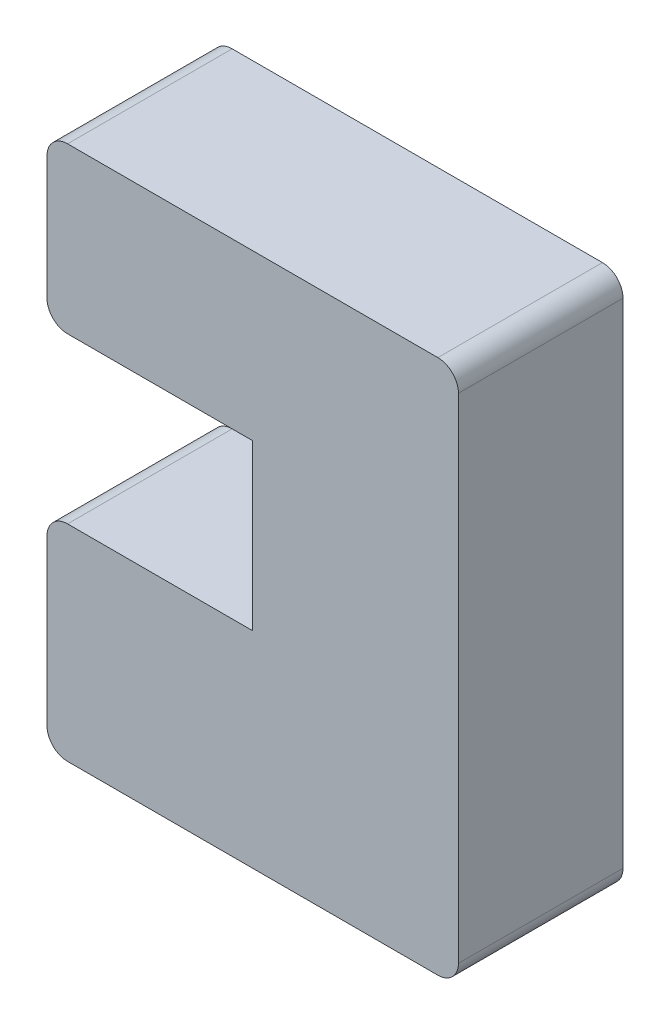
ISO-10303-21;
HEADER;
FILE_DESCRIPTION(('STEP AP214'),'2;1');
FILE_NAME('part.step','',(''),(''),'','','');
FILE_SCHEMA(('AUTOMOTIVE_DESIGN { 1 0 10303 214 1 1 1 1 }'));
ENDSEC;
DATA;
#1=APPLICATION_CONTEXT('core data for automotive mechanical design processes');
#2=APPLICATION_PROTOCOL_DEFINITION('international standard','automotive_design',2000,#1);
#3=PRODUCT_CONTEXT('',#1,'mechanical');
#4=PRODUCT('Part','Part','',(#3));
#5=PRODUCT_RELATED_PRODUCT_CATEGORY('part','',(#4));
#6=PRODUCT_DEFINITION_FORMATION('','',#4);
#7=PRODUCT_DEFINITION_CONTEXT('part definition',#1,'design');
#8=PRODUCT_DEFINITION('design','',#6,#7);
#9=PRODUCT_DEFINITION_SHAPE('','',#8);
#10=(LENGTH_UNIT() NAMED_UNIT(*) SI_UNIT(.MILLI.,.METRE.));
#11=(NAMED_UNIT(*) PLANE_ANGLE_UNIT() SI_UNIT($,.RADIAN.));
#12=(NAMED_UNIT(*) SI_UNIT($,.STERADIAN.) SOLID_ANGLE_UNIT());
#13=UNCERTAINTY_MEASURE_WITH_UNIT(LENGTH_MEASURE(1.E-05),#10,'distance_accuracy_value','');
#14=(GEOMETRIC_REPRESENTATION_CONTEXT(3) GLOBAL_UNCERTAINTY_ASSIGNED_CONTEXT((#13)) GLOBAL_UNIT_ASSIGNED_CONTEXT((#10,
#11,#12)) REPRESENTATION_CONTEXT('',''));
#15=CARTESIAN_POINT('',(0.,0.,0.));
#16=DIRECTION('',(0.,0.,1.));
#17=DIRECTION('',(1.,0.,0.));
#18=AXIS2_PLACEMENT_3D('',#15,#16,#17);
#19=CARTESIAN_POINT('',(1.,9.,8.));
#20=DIRECTION('',(0.,0.,-1.));
#21=DIRECTION('',(-1.,0.,0.));
#22=AXIS2_PLACEMENT_3D('',#19,#20,#21);
#23=CYLINDRICAL_SURFACE('',#22,1.);
#24=CARTESIAN_POINT('',(1.,9.,0.));
#25=DIRECTION('',(0.,0.,1.));
#26=DIRECTION('',(1.,0.,0.));
#27=AXIS2_PLACEMENT_3D('',#24,#25,#26);
#28=CIRCLE('',#27,1.);
#29=CARTESIAN_POINT('',(1.00000000000001,10.,0.));
#30=VERTEX_POINT('',#29);
#31=CARTESIAN_POINT('',(0.,8.99999999999999,0.));
#32=VERTEX_POINT('',#31);
#33=EDGE_CURVE('E167',#30,#32,#28,.T.);
#34=ORIENTED_EDGE('',*,*,#33,.T.);
#35=DIRECTION('',(0.,0.,-1.));
#36=VECTOR('',#35,1.);
#37=CARTESIAN_POINT('',(0.,8.99999999999999,8.));
#38=LINE('',#37,#36);
#39=CARTESIAN_POINT('',(0.,8.99999999999999,8.));
#40=VERTEX_POINT('',#39);
#41=EDGE_CURVE('E11',#40,#32,#38,.T.);
#42=ORIENTED_EDGE('',*,*,#41,.F.);
#43=CARTESIAN_POINT('',(1.,9.,8.));
#44=DIRECTION('',(0.,0.,1.));
#45=DIRECTION('',(1.,0.,0.));
#46=AXIS2_PLACEMENT_3D('',#43,#44,#45);
#47=CIRCLE('',#46,1.);
#48=CARTESIAN_POINT('',(1.00000000000001,10.,8.));
#49=VERTEX_POINT('',#48);
#50=EDGE_CURVE('E193',#49,#40,#47,.T.);
#51=ORIENTED_EDGE('',*,*,#50,.F.);
#52=DIRECTION('',(0.,0.,-1.));
#53=VECTOR('',#52,1.);
#54=CARTESIAN_POINT('',(1.00000000000001,10.,8.));
#55=LINE('',#54,#53);
#56=EDGE_CURVE('E163',#49,#30,#55,.T.);
#57=ORIENTED_EDGE('',*,*,#56,.T.);
#58=EDGE_LOOP('',(#34,#42,#51,#57));
#59=FACE_BOUND('',#58,.T.);
#60=ADVANCED_FACE('F35',(#59),#23,.T.);
#61=CARTESIAN_POINT('',(0.,8.99999999999999,8.));
#62=DIRECTION('',(1.,0.,0.));
#63=DIRECTION('',(0.,1.,0.));
#64=AXIS2_PLACEMENT_3D('',#61,#62,#63);
#65=PLANE('',#64);
#66=DIRECTION('',(0.,-1.,0.));
#67=VECTOR('',#66,1.);
#68=CARTESIAN_POINT('',(0.,8.99999999999999,0.));
#69=LINE('',#68,#67);
#70=CARTESIAN_POINT('',(0.,1.00000000000001,0.));
#71=VERTEX_POINT('',#70);
#72=EDGE_CURVE('E170',#32,#71,#69,.T.);
#73=ORIENTED_EDGE('',*,*,#72,.T.);
#74=DIRECTION('',(0.,0.,-1.));
#75=VECTOR('',#74,1.);
#76=CARTESIAN_POINT('',(0.,1.00000000000001,8.));
#77=LINE('',#76,#75);
#78=CARTESIAN_POINT('',(0.,1.00000000000001,8.));
#79=VERTEX_POINT('',#78);
#80=EDGE_CURVE('E43',#79,#71,#77,.T.);
#81=ORIENTED_EDGE('',*,*,#80,.F.);
#82=DIRECTION('',(0.,-1.,0.));
#83=VECTOR('',#82,1.);
#84=CARTESIAN_POINT('',(0.,8.99999999999999,8.));
#85=LINE('',#84,#83);
#86=EDGE_CURVE('E112',#40,#79,#85,.T.);
#87=ORIENTED_EDGE('',*,*,#86,.F.);
#88=ORIENTED_EDGE('',*,*,#41,.T.);
#89=EDGE_LOOP('',(#73,#81,#87,#88));
#90=FACE_BOUND('',#89,.T.);
#91=ADVANCED_FACE('F281',(#90),#65,.F.);
#92=CARTESIAN_POINT('',(1.,1.,8.));
#93=DIRECTION('',(0.,0.,-1.));
#94=DIRECTION('',(-1.,0.,0.));
#95=AXIS2_PLACEMENT_3D('',#92,#93,#94);
#96=CYLINDRICAL_SURFACE('',#95,1.);
#97=CARTESIAN_POINT('',(1.,1.,0.));
#98=DIRECTION('',(0.,0.,1.));
#99=DIRECTION('',(1.,0.,0.));
#100=AXIS2_PLACEMENT_3D('',#97,#98,#99);
#101=CIRCLE('',#100,1.);
#102=CARTESIAN_POINT('',(1.00000000000001,0.,0.));
#103=VERTEX_POINT('',#102);
#104=EDGE_CURVE('E172',#71,#103,#101,.T.);
#105=ORIENTED_EDGE('',*,*,#104,.T.);
#106=DIRECTION('',(0.,0.,-1.));
#107=VECTOR('',#106,1.);
#108=CARTESIAN_POINT('',(1.00000000000001,0.,8.));
#109=LINE('',#108,#107);
#110=CARTESIAN_POINT('',(1.00000000000001,0.,8.));
#111=VERTEX_POINT('',#110);
#112=EDGE_CURVE('E218',#111,#103,#109,.T.);
#113=ORIENTED_EDGE('',*,*,#112,.F.);
#114=CARTESIAN_POINT('',(1.,1.,8.));
#115=DIRECTION('',(0.,0.,1.));
#116=DIRECTION('',(1.,0.,0.));
#117=AXIS2_PLACEMENT_3D('',#114,#115,#116);
#118=CIRCLE('',#117,1.);
#119=EDGE_CURVE('E226',#79,#111,#118,.T.);
#120=ORIENTED_EDGE('',*,*,#119,.F.);
#121=ORIENTED_EDGE('',*,*,#80,.T.);
#122=EDGE_LOOP('',(#105,#113,#120,#121));
#123=FACE_BOUND('',#122,.T.);
#124=ADVANCED_FACE('F224',(#123),#96,.T.);
#125=CARTESIAN_POINT('',(1.00000000000001,0.,8.));
#126=DIRECTION('',(0.,1.,0.));
#127=DIRECTION('',(0.,0.,1.));
#128=AXIS2_PLACEMENT_3D('',#125,#126,#127);
#129=PLANE('',#128);
#130=DIRECTION('',(1.,0.,0.));
#131=VECTOR('',#130,1.);
#132=CARTESIAN_POINT('',(1.00000000000001,0.,0.));
#133=LINE('',#132,#131);
#134=CARTESIAN_POINT('',(19.,0.,0.));
#135=VERTEX_POINT('',#134);
#136=EDGE_CURVE('E174',#103,#135,#133,.T.);
#137=ORIENTED_EDGE('',*,*,#136,.T.);
#138=DIRECTION('',(0.,0.,-1.));
#139=VECTOR('',#138,1.);
#140=CARTESIAN_POINT('',(19.,0.,8.));
#141=LINE('',#140,#139);
#142=CARTESIAN_POINT('',(19.,0.,8.));
#143=VERTEX_POINT('',#142);
#144=EDGE_CURVE('E215',#143,#135,#141,.T.);
#145=ORIENTED_EDGE('',*,*,#144,.F.);
#146=DIRECTION('',(1.,0.,0.));
#147=VECTOR('',#146,1.);
#148=CARTESIAN_POINT('',(1.00000000000001,0.,8.));
#149=LINE('',#148,#147);
#150=EDGE_CURVE('E244',#111,#143,#149,.T.);
#151=ORIENTED_EDGE('',*,*,#150,.F.);
#152=ORIENTED_EDGE('',*,*,#112,.T.);
#153=EDGE_LOOP('',(#137,#145,#151,#152));
#154=FACE_BOUND('',#153,.T.);
#155=ADVANCED_FACE('F235',(#154),#129,.F.);
#156=CARTESIAN_POINT('',(19.,1.,8.));
#157=DIRECTION('',(0.,0.,-1.));
#158=DIRECTION('',(-1.,0.,0.));
#159=AXIS2_PLACEMENT_3D('',#156,#157,#158);
#160=CYLINDRICAL_SURFACE('',#159,1.);
#161=CARTESIAN_POINT('',(19.,1.,0.));
#162=DIRECTION('',(0.,0.,1.));
#163=DIRECTION('',(1.,0.,0.));
#164=AXIS2_PLACEMENT_3D('',#161,#162,#163);
#165=CIRCLE('',#164,1.);
#166=CARTESIAN_POINT('',(20.,1.00000000000001,0.));
#167=VERTEX_POINT('',#166);
#168=EDGE_CURVE('E176',#135,#167,#165,.T.);
#169=ORIENTED_EDGE('',*,*,#168,.T.);
#170=DIRECTION('',(0.,0.,-1.));
#171=VECTOR('',#170,1.);
#172=CARTESIAN_POINT('',(20.,1.00000000000001,8.));
#173=LINE('',#172,#171);
#174=CARTESIAN_POINT('',(20.,1.00000000000001,8.));
#175=VERTEX_POINT('',#174);
#176=EDGE_CURVE('E212',#175,#167,#173,.T.);
#177=ORIENTED_EDGE('',*,*,#176,.F.);
#178=CARTESIAN_POINT('',(19.,1.,8.));
#179=DIRECTION('',(0.,0.,1.));
#180=DIRECTION('',(1.,0.,0.));
#181=AXIS2_PLACEMENT_3D('',#178,#179,#180);
#182=CIRCLE('',#181,1.);
#183=EDGE_CURVE('E241',#143,#175,#182,.T.);
#184=ORIENTED_EDGE('',*,*,#183,.F.);
#185=ORIENTED_EDGE('',*,*,#144,.T.);
#186=EDGE_LOOP('',(#169,#177,#184,#185));
#187=FACE_BOUND('',#186,.T.);
#188=ADVANCED_FACE('F239',(#187),#160,.T.);
#189=CARTESIAN_POINT('',(20.,1.00000000000001,8.));
#190=DIRECTION('',(-1.,0.,0.));
#191=DIRECTION('',(0.,0.,1.));
#192=AXIS2_PLACEMENT_3D('',#189,#190,#191);
#193=PLANE('',#192);
#194=DIRECTION('',(0.,1.,0.));
#195=VECTOR('',#194,1.);
#196=CARTESIAN_POINT('',(20.,1.00000000000001,0.));
#197=LINE('',#196,#195);
#198=CARTESIAN_POINT('',(20.,25.,0.));
#199=VERTEX_POINT('',#198);
#200=EDGE_CURVE('E178',#167,#199,#197,.T.);
#201=ORIENTED_EDGE('',*,*,#200,.T.);
#202=DIRECTION('',(0.,0.,-1.));
#203=VECTOR('',#202,1.);
#204=CARTESIAN_POINT('',(20.,25.,8.));
#205=LINE('',#204,#203);
#206=CARTESIAN_POINT('',(20.,25.,8.));
#207=VERTEX_POINT('',#206);
#208=EDGE_CURVE('E209',#207,#199,#205,.T.);
#209=ORIENTED_EDGE('',*,*,#208,.F.);
#210=DIRECTION('',(0.,1.,0.));
#211=VECTOR('',#210,1.);
#212=CARTESIAN_POINT('',(20.,1.00000000000001,8.));
#213=LINE('',#212,#211);
#214=EDGE_CURVE('E243',#175,#207,#213,.T.);
#215=ORIENTED_EDGE('',*,*,#214,.F.);
#216=ORIENTED_EDGE('',*,*,#176,.T.);
#217=EDGE_LOOP('',(#201,#209,#215,#216));
#218=FACE_BOUND('',#217,.T.);
#219=ADVANCED_FACE('F294',(#218),#193,.F.);
#220=CARTESIAN_POINT('',(19.,25.,8.));
#221=DIRECTION('',(0.,0.,-1.));
#222=DIRECTION('',(-1.,0.,0.));
#223=AXIS2_PLACEMENT_3D('',#220,#221,#222);
#224=CYLINDRICAL_SURFACE('',#223,1.);
#225=CARTESIAN_POINT('',(19.,25.,0.));
#226=DIRECTION('',(0.,0.,1.));
#227=DIRECTION('',(1.,0.,0.));
#228=AXIS2_PLACEMENT_3D('',#225,#226,#227);
#229=CIRCLE('',#228,1.);
#230=CARTESIAN_POINT('',(19.,26.,0.));
#231=VERTEX_POINT('',#230);
#232=EDGE_CURVE('E180',#199,#231,#229,.T.);
#233=ORIENTED_EDGE('',*,*,#232,.T.);
#234=DIRECTION('',(0.,0.,-1.));
#235=VECTOR('',#234,1.);
#236=CARTESIAN_POINT('',(19.,26.,8.));
#237=LINE('',#236,#235);
#238=CARTESIAN_POINT('',(19.,26.,8.));
#239=VERTEX_POINT('',#238);
#240=EDGE_CURVE('E206',#239,#231,#237,.T.);
#241=ORIENTED_EDGE('',*,*,#240,.F.);
#242=CARTESIAN_POINT('',(19.,25.,8.));
#243=DIRECTION('',(0.,0.,1.));
#244=DIRECTION('',(1.,0.,0.));
#245=AXIS2_PLACEMENT_3D('',#242,#243,#244);
#246=CIRCLE('',#245,1.);
#247=EDGE_CURVE('E246',#207,#239,#246,.T.);
#248=ORIENTED_EDGE('',*,*,#247,.F.);
#249=ORIENTED_EDGE('',*,*,#208,.T.);
#250=EDGE_LOOP('',(#233,#241,#248,#249));
#251=FACE_BOUND('',#250,.T.);
#252=ADVANCED_FACE('F297',(#251),#224,.T.);
#253=CARTESIAN_POINT('',(19.,26.,8.));
#254=DIRECTION('',(0.,-1.,0.));
#255=DIRECTION('',(1.,0.,0.));
#256=AXIS2_PLACEMENT_3D('',#253,#254,#255);
#257=PLANE('',#256);
#258=DIRECTION('',(-1.,0.,0.));
#259=VECTOR('',#258,1.);
#260=CARTESIAN_POINT('',(19.,26.,0.));
#261=LINE('',#260,#259);
#262=CARTESIAN_POINT('',(1.00000000000001,26.,0.));
#263=VERTEX_POINT('',#262);
#264=EDGE_CURVE('E182',#231,#263,#261,.T.);
#265=ORIENTED_EDGE('',*,*,#264,.T.);
#266=DIRECTION('',(0.,0.,-1.));
#267=VECTOR('',#266,1.);
#268=CARTESIAN_POINT('',(1.00000000000001,26.,8.));
#269=LINE('',#268,#267);
#270=CARTESIAN_POINT('',(1.00000000000001,26.,8.));
#271=VERTEX_POINT('',#270);
#272=EDGE_CURVE('E203',#271,#263,#269,.T.);
#273=ORIENTED_EDGE('',*,*,#272,.F.);
#274=DIRECTION('',(-1.,0.,0.));
#275=VECTOR('',#274,1.);
#276=CARTESIAN_POINT('',(19.,26.,8.));
#277=LINE('',#276,#275);
#278=EDGE_CURVE('E252',#239,#271,#277,.T.);
#279=ORIENTED_EDGE('',*,*,#278,.F.);
#280=ORIENTED_EDGE('',*,*,#240,.T.);
#281=EDGE_LOOP('',(#265,#273,#279,#280));
#282=FACE_BOUND('',#281,.T.);
#283=ADVANCED_FACE('F301',(#282),#257,.F.);
#284=CARTESIAN_POINT('',(1.,25.,8.));
#285=DIRECTION('',(0.,0.,-1.));
#286=DIRECTION('',(-1.,0.,0.));
#287=AXIS2_PLACEMENT_3D('',#284,#285,#286);
#288=CYLINDRICAL_SURFACE('',#287,1.);
#289=CARTESIAN_POINT('',(1.,25.,0.));
#290=DIRECTION('',(0.,0.,1.));
#291=DIRECTION('',(-1.,0.,0.));
#292=AXIS2_PLACEMENT_3D('',#289,#290,#291);
#293=CIRCLE('',#292,1.);
#294=CARTESIAN_POINT('',(0.,25.,0.));
#295=VERTEX_POINT('',#294);
#296=EDGE_CURVE('E184',#263,#295,#293,.T.);
#297=ORIENTED_EDGE('',*,*,#296,.T.);
#298=DIRECTION('',(0.,0.,-1.));
#299=VECTOR('',#298,1.);
#300=CARTESIAN_POINT('',(0.,25.,8.));
#301=LINE('',#300,#299);
#302=CARTESIAN_POINT('',(0.,25.,8.));
#303=VERTEX_POINT('',#302);
#304=EDGE_CURVE('E200',#303,#295,#301,.T.);
#305=ORIENTED_EDGE('',*,*,#304,.F.);
#306=CARTESIAN_POINT('',(1.,25.,8.));
#307=DIRECTION('',(0.,0.,1.));
#308=DIRECTION('',(-1.,0.,0.));
#309=AXIS2_PLACEMENT_3D('',#306,#307,#308);
#310=CIRCLE('',#309,1.);
#311=EDGE_CURVE('E254',#271,#303,#310,.T.);
#312=ORIENTED_EDGE('',*,*,#311,.F.);
#313=ORIENTED_EDGE('',*,*,#272,.T.);
#314=EDGE_LOOP('',(#297,#305,#312,#313));
#315=FACE_BOUND('',#314,.T.);
#316=ADVANCED_FACE('F305',(#315),#288,.T.);
#317=CARTESIAN_POINT('',(0.,25.,8.));
#318=DIRECTION('',(1.,0.,0.));
#319=DIRECTION('',(0.,1.,0.));
#320=AXIS2_PLACEMENT_3D('',#317,#318,#319);
#321=PLANE('',#320);
#322=DIRECTION('',(0.,-1.,0.));
#323=VECTOR('',#322,1.);
#324=CARTESIAN_POINT('',(0.,25.,0.));
#325=LINE('',#324,#323);
#326=CARTESIAN_POINT('',(0.,19.,0.));
#327=VERTEX_POINT('',#326);
#328=EDGE_CURVE('E186',#295,#327,#325,.T.);
#329=ORIENTED_EDGE('',*,*,#328,.T.);
#330=DIRECTION('',(0.,0.,-1.));
#331=VECTOR('',#330,1.);
#332=CARTESIAN_POINT('',(0.,19.,8.));
#333=LINE('',#332,#331);
#334=CARTESIAN_POINT('',(0.,19.,8.));
#335=VERTEX_POINT('',#334);
#336=EDGE_CURVE('E197',#335,#327,#333,.T.);
#337=ORIENTED_EDGE('',*,*,#336,.F.);
#338=DIRECTION('',(0.,-1.,0.));
#339=VECTOR('',#338,1.);
#340=CARTESIAN_POINT('',(0.,25.,8.));
#341=LINE('',#340,#339);
#342=EDGE_CURVE('E256',#303,#335,#341,.T.);
#343=ORIENTED_EDGE('',*,*,#342,.F.);
#344=ORIENTED_EDGE('',*,*,#304,.T.);
#345=EDGE_LOOP('',(#329,#337,#343,#344));
#346=FACE_BOUND('',#345,.T.);
#347=ADVANCED_FACE('F262',(#346),#321,.F.);
#348=CARTESIAN_POINT('',(1.,19.,8.));
#349=DIRECTION('',(0.,0.,-1.));
#350=DIRECTION('',(-1.,0.,0.));
#351=AXIS2_PLACEMENT_3D('',#348,#349,#350);
#352=CYLINDRICAL_SURFACE('',#351,1.);
#353=CARTESIAN_POINT('',(1.,19.,0.));
#354=DIRECTION('',(0.,0.,1.));
#355=DIRECTION('',(1.,0.,0.));
#356=AXIS2_PLACEMENT_3D('',#353,#354,#355);
#357=CIRCLE('',#356,1.);
#358=CARTESIAN_POINT('',(1.00000000000001,18.,0.));
#359=VERTEX_POINT('',#358);
#360=EDGE_CURVE('E188',#327,#359,#357,.T.);
#361=ORIENTED_EDGE('',*,*,#360,.T.);
#362=DIRECTION('',(0.,0.,-1.));
#363=VECTOR('',#362,1.);
#364=CARTESIAN_POINT('',(1.00000000000001,18.,8.));
#365=LINE('',#364,#363);
#366=CARTESIAN_POINT('',(1.00000000000001,18.,8.));
#367=VERTEX_POINT('',#366);
#368=EDGE_CURVE('E158',#367,#359,#365,.T.);
#369=ORIENTED_EDGE('',*,*,#368,.F.);
#370=CARTESIAN_POINT('',(1.,19.,8.));
#371=DIRECTION('',(0.,0.,1.));
#372=DIRECTION('',(1.,0.,0.));
#373=AXIS2_PLACEMENT_3D('',#370,#371,#372);
#374=CIRCLE('',#373,1.);
#375=EDGE_CURVE('E149',#335,#367,#374,.T.);
#376=ORIENTED_EDGE('',*,*,#375,.F.);
#377=ORIENTED_EDGE('',*,*,#336,.T.);
#378=EDGE_LOOP('',(#361,#369,#376,#377));
#379=FACE_BOUND('',#378,.T.);
#380=ADVANCED_FACE('F266',(#379),#352,.T.);
#381=CARTESIAN_POINT('',(1.00000000000001,18.,8.));
#382=DIRECTION('',(0.,1.,0.));
#383=DIRECTION('',(0.,0.,1.));
#384=AXIS2_PLACEMENT_3D('',#381,#382,#383);
#385=PLANE('',#384);
#386=DIRECTION('',(1.,0.,0.));
#387=VECTOR('',#386,1.);
#388=CARTESIAN_POINT('',(1.00000000000001,18.,0.));
#389=LINE('',#388,#387);
#390=CARTESIAN_POINT('',(10.,18.,0.));
#391=VERTEX_POINT('',#390);
#392=EDGE_CURVE('E157',#359,#391,#389,.T.);
#393=ORIENTED_EDGE('',*,*,#392,.T.);
#394=DIRECTION('',(0.,0.,-1.));
#395=VECTOR('',#394,1.);
#396=CARTESIAN_POINT('',(10.,18.,8.));
#397=LINE('',#396,#395);
#398=CARTESIAN_POINT('',(10.,18.,8.));
#399=VERTEX_POINT('',#398);
#400=EDGE_CURVE('E154',#399,#391,#397,.T.);
#401=ORIENTED_EDGE('',*,*,#400,.F.);
#402=DIRECTION('',(1.,0.,0.));
#403=VECTOR('',#402,1.);
#404=CARTESIAN_POINT('',(1.00000000000001,18.,8.));
#405=LINE('',#404,#403);
#406=EDGE_CURVE('E143',#367,#399,#405,.T.);
#407=ORIENTED_EDGE('',*,*,#406,.F.);
#408=ORIENTED_EDGE('',*,*,#368,.T.);
#409=EDGE_LOOP('',(#393,#401,#407,#408));
#410=FACE_BOUND('',#409,.T.);
#411=ADVANCED_FACE('F155',(#410),#385,.F.);
#412=CARTESIAN_POINT('',(10.,18.,8.));
#413=DIRECTION('',(1.,0.,0.));
#414=DIRECTION('',(0.,0.,-1.));
#415=AXIS2_PLACEMENT_3D('',#412,#413,#414);
#416=PLANE('',#415);
#417=DIRECTION('',(0.,-1.,0.));
#418=VECTOR('',#417,1.);
#419=CARTESIAN_POINT('',(10.,18.,0.));
#420=LINE('',#419,#418);
#421=CARTESIAN_POINT('',(10.,10.,0.));
#422=VERTEX_POINT('',#421);
#423=EDGE_CURVE('E98',#391,#422,#420,.T.);
#424=ORIENTED_EDGE('',*,*,#423,.T.);
#425=DIRECTION('',(0.,0.,-1.));
#426=VECTOR('',#425,1.);
#427=CARTESIAN_POINT('',(10.,10.,8.));
#428=LINE('',#427,#426);
#429=CARTESIAN_POINT('',(10.,10.,8.));
#430=VERTEX_POINT('',#429);
#431=EDGE_CURVE('E159',#430,#422,#428,.T.);
#432=ORIENTED_EDGE('',*,*,#431,.F.);
#433=DIRECTION('',(0.,-1.,0.));
#434=VECTOR('',#433,1.);
#435=CARTESIAN_POINT('',(10.,18.,8.));
#436=LINE('',#435,#434);
#437=EDGE_CURVE('E147',#399,#430,#436,.T.);
#438=ORIENTED_EDGE('',*,*,#437,.F.);
#439=ORIENTED_EDGE('',*,*,#400,.T.);
#440=EDGE_LOOP('',(#424,#432,#438,#439));
#441=FACE_BOUND('',#440,.T.);
#442=ADVANCED_FACE('F161',(#441),#416,.F.);
#443=CARTESIAN_POINT('',(10.,10.,8.));
#444=DIRECTION('',(0.,-1.,0.));
#445=DIRECTION('',(1.,0.,0.));
#446=AXIS2_PLACEMENT_3D('',#443,#444,#445);
#447=PLANE('',#446);
#448=DIRECTION('',(-1.,0.,0.));
#449=VECTOR('',#448,1.);
#450=CARTESIAN_POINT('',(10.,10.,0.));
#451=LINE('',#450,#449);
#452=EDGE_CURVE('E104',#422,#30,#451,.T.);
#453=ORIENTED_EDGE('',*,*,#452,.T.);
#454=ORIENTED_EDGE('',*,*,#56,.F.);
#455=DIRECTION('',(-1.,0.,0.));
#456=VECTOR('',#455,1.);
#457=CARTESIAN_POINT('',(10.,10.,8.));
#458=LINE('',#457,#456);
#459=EDGE_CURVE('E51',#430,#49,#458,.T.);
#460=ORIENTED_EDGE('',*,*,#459,.F.);
#461=ORIENTED_EDGE('',*,*,#431,.T.);
#462=EDGE_LOOP('',(#453,#454,#460,#461));
#463=FACE_BOUND('',#462,.T.);
#464=ADVANCED_FACE('F270',(#463),#447,.F.);
#465=CARTESIAN_POINT('',(1.,9.,8.));
#466=DIRECTION('',(0.,0.,1.));
#467=DIRECTION('',(1.,0.,0.));
#468=AXIS2_PLACEMENT_3D('',#465,#466,#467);
#469=PLANE('',#468);
#470=ORIENTED_EDGE('',*,*,#50,.T.);
#471=ORIENTED_EDGE('',*,*,#86,.T.);
#472=ORIENTED_EDGE('',*,*,#119,.T.);
#473=ORIENTED_EDGE('',*,*,#150,.T.);
#474=ORIENTED_EDGE('',*,*,#183,.T.);
#475=ORIENTED_EDGE('',*,*,#214,.T.);
#476=ORIENTED_EDGE('',*,*,#247,.T.);
#477=ORIENTED_EDGE('',*,*,#278,.T.);
#478=ORIENTED_EDGE('',*,*,#311,.T.);
#479=ORIENTED_EDGE('',*,*,#342,.T.);
#480=ORIENTED_EDGE('',*,*,#375,.T.);
#481=ORIENTED_EDGE('',*,*,#406,.T.);
#482=ORIENTED_EDGE('',*,*,#437,.T.);
#483=ORIENTED_EDGE('',*,*,#459,.T.);
#484=EDGE_LOOP('',(#470,#471,#472,#473,#474,#475,#476,#477,#478,#479,#480,#481,#482,#483));
#485=FACE_BOUND('',#484,.T.);
#486=ADVANCED_FACE('F145',(#485),#469,.T.);
#487=CARTESIAN_POINT('',(1.,9.,0.));
#488=DIRECTION('',(0.,0.,1.));
#489=DIRECTION('',(1.,0.,0.));
#490=AXIS2_PLACEMENT_3D('',#487,#488,#489);
#491=PLANE('',#490);
#492=ORIENTED_EDGE('',*,*,#33,.F.);
#493=ORIENTED_EDGE('',*,*,#452,.F.);
#494=ORIENTED_EDGE('',*,*,#423,.F.);
#495=ORIENTED_EDGE('',*,*,#392,.F.);
#496=ORIENTED_EDGE('',*,*,#360,.F.);
#497=ORIENTED_EDGE('',*,*,#328,.F.);
#498=ORIENTED_EDGE('',*,*,#296,.F.);
#499=ORIENTED_EDGE('',*,*,#264,.F.);
#500=ORIENTED_EDGE('',*,*,#232,.F.);
#501=ORIENTED_EDGE('',*,*,#200,.F.);
#502=ORIENTED_EDGE('',*,*,#168,.F.);
#503=ORIENTED_EDGE('',*,*,#136,.F.);
#504=ORIENTED_EDGE('',*,*,#104,.F.);
#505=ORIENTED_EDGE('',*,*,#72,.F.);
#506=EDGE_LOOP('',(#492,#493,#494,#495,#496,#497,#498,#499,#500,#501,#502,#503,#504,#505));
#507=FACE_BOUND('',#506,.T.);
#508=ADVANCED_FACE('F230',(#507),#491,.F.);
#509=CLOSED_SHELL('',(#60,#91,#124,#155,#188,#219,#252,#283,#316,#347,#380,#411,#442,#464,#486,#508));
#510=MANIFOLD_SOLID_BREP('B2',#509);
#511=ADVANCED_BREP_SHAPE_REPRESENTATION('',(#18,#510),#14);
#512=SHAPE_DEFINITION_REPRESENTATION(#9,#511);
ENDSEC;
END-ISO-10303-21;
